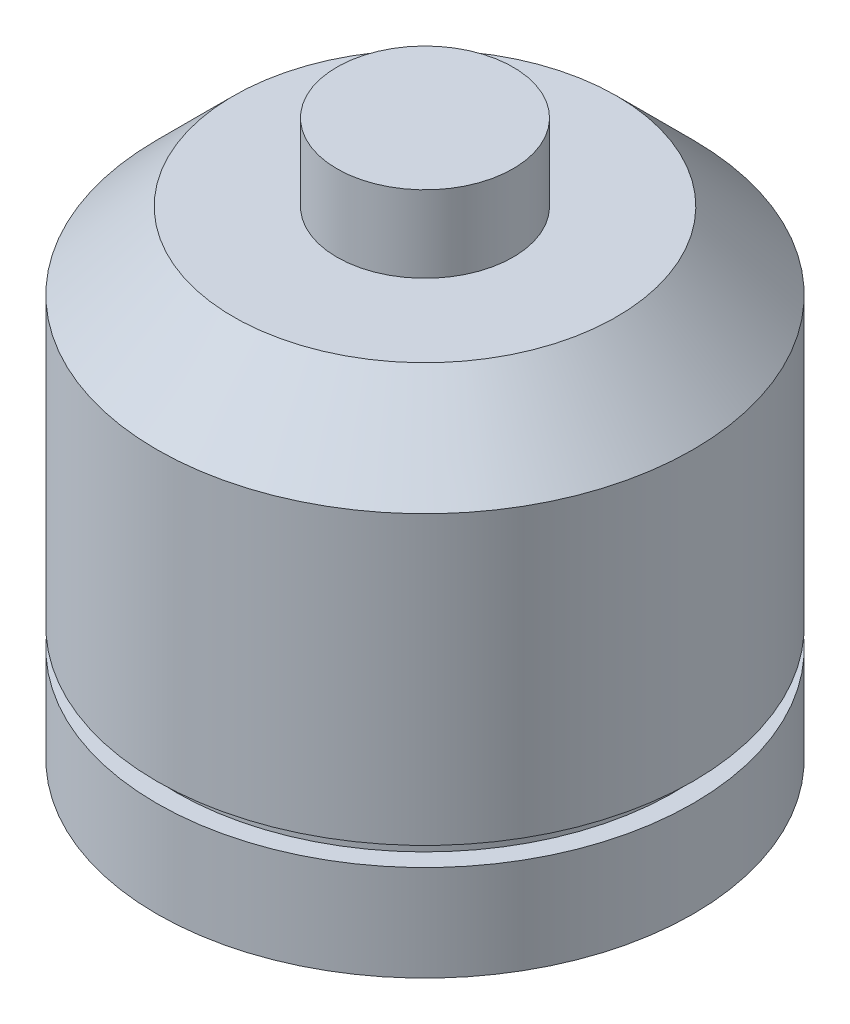
ISO-10303-21;
HEADER;
FILE_DESCRIPTION(('STEP AP214'),'2;1');
FILE_NAME('part.step','',(''),(''),'','','');
FILE_SCHEMA(('AUTOMOTIVE_DESIGN { 1 0 10303 214 1 1 1 1 }'));
ENDSEC;
DATA;
#1=APPLICATION_CONTEXT('core data for automotive mechanical design processes');
#2=APPLICATION_PROTOCOL_DEFINITION('international standard','automotive_design',2000,#1);
#3=PRODUCT_CONTEXT('',#1,'mechanical');
#4=PRODUCT('Part','Part','',(#3));
#5=PRODUCT_RELATED_PRODUCT_CATEGORY('part','',(#4));
#6=PRODUCT_DEFINITION_FORMATION('','',#4);
#7=PRODUCT_DEFINITION_CONTEXT('part definition',#1,'design');
#8=PRODUCT_DEFINITION('design','',#6,#7);
#9=PRODUCT_DEFINITION_SHAPE('','',#8);
#10=(LENGTH_UNIT() NAMED_UNIT(*) SI_UNIT(.MILLI.,.METRE.));
#11=(NAMED_UNIT(*) PLANE_ANGLE_UNIT() SI_UNIT($,.RADIAN.));
#12=(NAMED_UNIT(*) SI_UNIT($,.STERADIAN.) SOLID_ANGLE_UNIT());
#13=UNCERTAINTY_MEASURE_WITH_UNIT(LENGTH_MEASURE(1.E-05),#10,'distance_accuracy_value','');
#14=(GEOMETRIC_REPRESENTATION_CONTEXT(3) GLOBAL_UNCERTAINTY_ASSIGNED_CONTEXT((#13)) GLOBAL_UNIT_ASSIGNED_CONTEXT((#10,
#11,#12)) REPRESENTATION_CONTEXT('',''));
#15=CARTESIAN_POINT('',(0.,0.,0.));
#16=DIRECTION('',(0.,0.,1.));
#17=DIRECTION('',(1.,0.,0.));
#18=AXIS2_PLACEMENT_3D('',#15,#16,#17);
#19=CARTESIAN_POINT('',(0.,12.1749999999963,0.));
#20=DIRECTION('',(0.,1.,0.));
#21=DIRECTION('',(0.,0.,1.));
#22=AXIS2_PLACEMENT_3D('',#19,#20,#21);
#23=CYLINDRICAL_SURFACE('',#22,14.);
#24=CARTESIAN_POINT('',(0.,-7.82500000000368,0.));
#25=DIRECTION('',(0.,1.,0.));
#26=DIRECTION('',(0.,0.,1.));
#27=AXIS2_PLACEMENT_3D('',#24,#25,#26);
#28=CIRCLE('',#27,14.);
#29=CARTESIAN_POINT('',(0.,-7.82500000000368,14.));
#30=VERTEX_POINT('',#29);
#31=EDGE_CURVE('E50',#30,#30,#28,.T.);
#32=ORIENTED_EDGE('',*,*,#31,.F.);
#33=EDGE_LOOP('',(#32));
#34=FACE_BOUND('',#33,.T.);
#35=CARTESIAN_POINT('',(0.,-12.8250000000037,0.));
#36=DIRECTION('',(0.,1.,0.));
#37=DIRECTION('',(0.,0.,1.));
#38=AXIS2_PLACEMENT_3D('',#35,#36,#37);
#39=CIRCLE('',#38,14.);
#40=CARTESIAN_POINT('',(0.,-12.8250000000037,14.));
#41=VERTEX_POINT('',#40);
#42=EDGE_CURVE('E71',#41,#41,#39,.T.);
#43=ORIENTED_EDGE('',*,*,#42,.T.);
#44=EDGE_LOOP('',(#43));
#45=FACE_BOUND('',#44,.T.);
#46=ADVANCED_FACE('F38',(#34,#45),#23,.T.);
#47=CARTESIAN_POINT('',(0.,-7.82500000000368,-13.));
#48=DIRECTION('',(0.,-1.,0.));
#49=DIRECTION('',(0.,0.,-1.));
#50=AXIS2_PLACEMENT_3D('',#47,#48,#49);
#51=PLANE('',#50);
#52=CARTESIAN_POINT('',(0.,-7.82500000000368,0.));
#53=DIRECTION('',(0.,1.,0.));
#54=DIRECTION('',(0.,0.,1.));
#55=AXIS2_PLACEMENT_3D('',#52,#53,#54);
#56=CIRCLE('',#55,13.);
#57=CARTESIAN_POINT('',(0.,-7.82500000000368,13.));
#58=VERTEX_POINT('',#57);
#59=EDGE_CURVE('E54',#58,#58,#56,.T.);
#60=ORIENTED_EDGE('',*,*,#59,.F.);
#61=EDGE_LOOP('',(#60));
#62=FACE_BOUND('',#61,.T.);
#63=ORIENTED_EDGE('',*,*,#31,.T.);
#64=EDGE_LOOP('',(#63));
#65=FACE_BOUND('',#64,.T.);
#66=ADVANCED_FACE('F89',(#62,#65),#51,.F.);
#67=CARTESIAN_POINT('',(0.,12.1749999999963,0.));
#68=DIRECTION('',(0.,1.,0.));
#69=DIRECTION('',(0.,0.,1.));
#70=AXIS2_PLACEMENT_3D('',#67,#68,#69);
#71=CYLINDRICAL_SURFACE('',#70,13.);
#72=CARTESIAN_POINT('',(0.,-6.82500000000368,0.));
#73=DIRECTION('',(0.,1.,0.));
#74=DIRECTION('',(0.,0.,1.));
#75=AXIS2_PLACEMENT_3D('',#72,#73,#74);
#76=CIRCLE('',#75,13.);
#77=CARTESIAN_POINT('',(0.,-6.82500000000368,13.));
#78=VERTEX_POINT('',#77);
#79=EDGE_CURVE('E59',#78,#78,#76,.T.);
#80=ORIENTED_EDGE('',*,*,#79,.F.);
#81=EDGE_LOOP('',(#80));
#82=FACE_BOUND('',#81,.T.);
#83=ORIENTED_EDGE('',*,*,#59,.T.);
#84=EDGE_LOOP('',(#83));
#85=FACE_BOUND('',#84,.T.);
#86=ADVANCED_FACE('F94',(#82,#85),#71,.T.);
#87=CARTESIAN_POINT('',(0.,-6.82500000000368,-14.));
#88=DIRECTION('',(0.,1.,0.));
#89=DIRECTION('',(0.,0.,1.));
#90=AXIS2_PLACEMENT_3D('',#87,#88,#89);
#91=PLANE('',#90);
#92=CARTESIAN_POINT('',(0.,-6.82500000000368,0.));
#93=DIRECTION('',(0.,1.,0.));
#94=DIRECTION('',(0.,0.,1.));
#95=AXIS2_PLACEMENT_3D('',#92,#93,#94);
#96=CIRCLE('',#95,14.);
#97=CARTESIAN_POINT('',(0.,-6.82500000000368,14.));
#98=VERTEX_POINT('',#97);
#99=EDGE_CURVE('E62',#98,#98,#96,.T.);
#100=ORIENTED_EDGE('',*,*,#99,.F.);
#101=EDGE_LOOP('',(#100));
#102=FACE_BOUND('',#101,.T.);
#103=ORIENTED_EDGE('',*,*,#79,.T.);
#104=EDGE_LOOP('',(#103));
#105=FACE_BOUND('',#104,.T.);
#106=ADVANCED_FACE('F101',(#102,#105),#91,.F.);
#107=CARTESIAN_POINT('',(0.,12.1749999999963,0.));
#108=DIRECTION('',(0.,1.,0.));
#109=DIRECTION('',(0.,0.,1.));
#110=AXIS2_PLACEMENT_3D('',#107,#108,#109);
#111=CYLINDRICAL_SURFACE('',#110,14.);
#112=CARTESIAN_POINT('',(0.,8.17499999999629,0.));
#113=DIRECTION('',(0.,-1.,0.));
#114=DIRECTION('',(0.,0.,-1.));
#115=AXIS2_PLACEMENT_3D('',#112,#113,#114);
#116=CIRCLE('',#115,14.);
#117=CARTESIAN_POINT('',(0.,8.17499999999629,-14.));
#118=VERTEX_POINT('',#117);
#119=EDGE_CURVE('E10',#118,#118,#116,.T.);
#120=ORIENTED_EDGE('',*,*,#119,.T.);
#121=EDGE_LOOP('',(#120));
#122=FACE_BOUND('',#121,.T.);
#123=ORIENTED_EDGE('',*,*,#99,.T.);
#124=EDGE_LOOP('',(#123));
#125=FACE_BOUND('',#124,.T.);
#126=ADVANCED_FACE('F105',(#122,#125),#111,.T.);
#127=CARTESIAN_POINT('',(0.,12.1749999999963,-14.));
#128=DIRECTION('',(0.,-1.,0.));
#129=DIRECTION('',(0.,0.,-1.));
#130=AXIS2_PLACEMENT_3D('',#127,#128,#129);
#131=PLANE('',#130);
#132=CARTESIAN_POINT('',(0.,12.1749999999963,0.));
#133=DIRECTION('',(0.,-1.,0.));
#134=DIRECTION('',(0.,0.,-1.));
#135=AXIS2_PLACEMENT_3D('',#132,#133,#134);
#136=CIRCLE('',#135,9.99999999999998);
#137=CARTESIAN_POINT('',(0.,12.1749999999963,-9.99999999999999));
#138=VERTEX_POINT('',#137);
#139=EDGE_CURVE('E46',#138,#138,#136,.F.);
#140=ORIENTED_EDGE('',*,*,#139,.T.);
#141=EDGE_LOOP('',(#140));
#142=FACE_BOUND('',#141,.T.);
#143=CARTESIAN_POINT('',(0.,12.1749999999963,0.));
#144=DIRECTION('',(0.,1.,0.));
#145=DIRECTION('',(0.,0.,1.));
#146=AXIS2_PLACEMENT_3D('',#143,#144,#145);
#147=CIRCLE('',#146,4.6);
#148=CARTESIAN_POINT('',(0.,12.1749999999963,4.59999999999999));
#149=VERTEX_POINT('',#148);
#150=EDGE_CURVE('E65',#149,#149,#147,.T.);
#151=ORIENTED_EDGE('',*,*,#150,.F.);
#152=EDGE_LOOP('',(#151));
#153=FACE_BOUND('',#152,.T.);
#154=ADVANCED_FACE('F109',(#142,#153),#131,.F.);
#155=CARTESIAN_POINT('',(0.,12.1749999999963,0.));
#156=DIRECTION('',(0.,1.,0.));
#157=DIRECTION('',(0.,0.,1.));
#158=AXIS2_PLACEMENT_3D('',#155,#156,#157);
#159=CYLINDRICAL_SURFACE('',#158,4.6);
#160=CARTESIAN_POINT('',(0.,16.1749999999963,0.));
#161=DIRECTION('',(0.,1.,0.));
#162=DIRECTION('',(0.,0.,1.));
#163=AXIS2_PLACEMENT_3D('',#160,#161,#162);
#164=CIRCLE('',#163,4.6);
#165=CARTESIAN_POINT('',(0.,16.1749999999963,4.59999999999999));
#166=VERTEX_POINT('',#165);
#167=EDGE_CURVE('E68',#166,#166,#164,.T.);
#168=ORIENTED_EDGE('',*,*,#167,.F.);
#169=EDGE_LOOP('',(#168));
#170=FACE_BOUND('',#169,.T.);
#171=ORIENTED_EDGE('',*,*,#150,.T.);
#172=EDGE_LOOP('',(#171));
#173=FACE_BOUND('',#172,.T.);
#174=ADVANCED_FACE('F85',(#170,#173),#159,.T.);
#175=CARTESIAN_POINT('',(0.,16.1749999999963,-4.6));
#176=DIRECTION('',(0.,-1.,0.));
#177=DIRECTION('',(0.,0.,-1.));
#178=AXIS2_PLACEMENT_3D('',#175,#176,#177);
#179=PLANE('',#178);
#180=ORIENTED_EDGE('',*,*,#167,.T.);
#181=EDGE_LOOP('',(#180));
#182=FACE_BOUND('',#181,.T.);
#183=ADVANCED_FACE('F78',(#182),#179,.F.);
#184=CARTESIAN_POINT('',(0.,-12.8250000000037,0.));
#185=DIRECTION('',(0.,1.,0.));
#186=DIRECTION('',(0.,0.,1.));
#187=AXIS2_PLACEMENT_3D('',#184,#185,#186);
#188=PLANE('',#187);
#189=ORIENTED_EDGE('',*,*,#42,.F.);
#190=EDGE_LOOP('',(#189));
#191=FACE_BOUND('',#190,.T.);
#192=ADVANCED_FACE('F76',(#191),#188,.F.);
#193=CARTESIAN_POINT('',(0.,12.1749999999963,0.));
#194=DIRECTION('',(0.,-1.,0.));
#195=DIRECTION('',(0.,0.,-1.));
#196=AXIS2_PLACEMENT_3D('',#193,#194,#195);
#197=CONICAL_SURFACE('',#196,9.99999999999998,0.785398163397447);
#198=ORIENTED_EDGE('',*,*,#119,.F.);
#199=EDGE_LOOP('',(#198));
#200=FACE_BOUND('',#199,.T.);
#201=ORIENTED_EDGE('',*,*,#139,.F.);
#202=EDGE_LOOP('',(#201));
#203=FACE_BOUND('',#202,.T.);
#204=ADVANCED_FACE('F41',(#200,#203),#197,.T.);
#205=CLOSED_SHELL('',(#46,#66,#86,#106,#126,#154,#174,#183,#192,#204));
#206=MANIFOLD_SOLID_BREP('B2',#205);
#207=ADVANCED_BREP_SHAPE_REPRESENTATION('',(#18,#206),#14);
#208=SHAPE_DEFINITION_REPRESENTATION(#9,#207);
ENDSEC;
END-ISO-10303-21;
